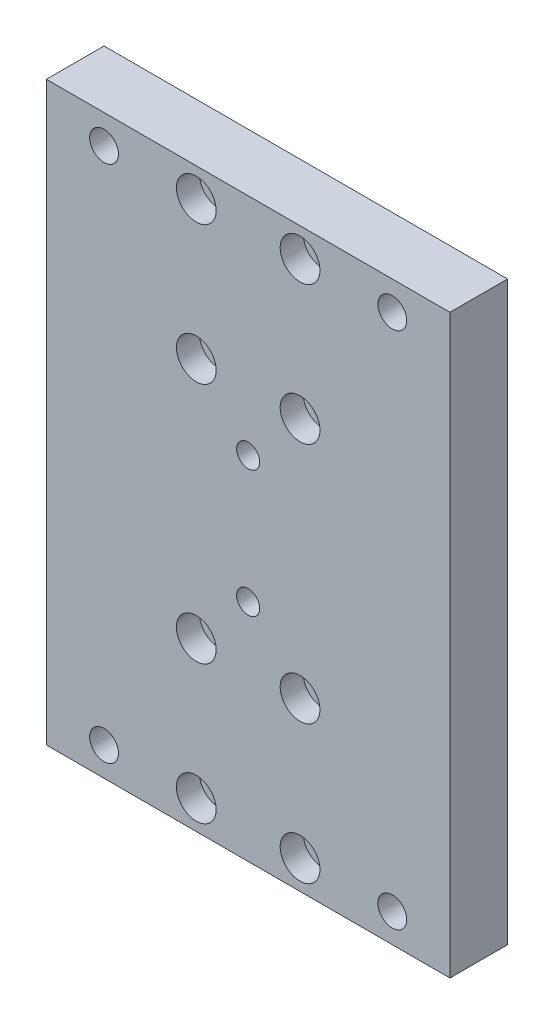
ISO-10303-21;
HEADER;
FILE_DESCRIPTION(('STEP AP214'),'2;1');
FILE_NAME('part.step','',(''),(''),'','','');
FILE_SCHEMA(('AUTOMOTIVE_DESIGN { 1 0 10303 214 1 1 1 1 }'));
ENDSEC;
DATA;
#1=APPLICATION_CONTEXT('core data for automotive mechanical design processes');
#2=APPLICATION_PROTOCOL_DEFINITION('international standard','automotive_design',2000,#1);
#3=PRODUCT_CONTEXT('',#1,'mechanical');
#4=PRODUCT('Part','Part','',(#3));
#5=PRODUCT_RELATED_PRODUCT_CATEGORY('part','',(#4));
#6=PRODUCT_DEFINITION_FORMATION('','',#4);
#7=PRODUCT_DEFINITION_CONTEXT('part definition',#1,'design');
#8=PRODUCT_DEFINITION('design','',#6,#7);
#9=PRODUCT_DEFINITION_SHAPE('','',#8);
#10=(LENGTH_UNIT() NAMED_UNIT(*) SI_UNIT(.MILLI.,.METRE.));
#11=(NAMED_UNIT(*) PLANE_ANGLE_UNIT() SI_UNIT($,.RADIAN.));
#12=(NAMED_UNIT(*) SI_UNIT($,.STERADIAN.) SOLID_ANGLE_UNIT());
#13=UNCERTAINTY_MEASURE_WITH_UNIT(LENGTH_MEASURE(1.E-05),#10,'distance_accuracy_value','');
#14=(GEOMETRIC_REPRESENTATION_CONTEXT(3) GLOBAL_UNCERTAINTY_ASSIGNED_CONTEXT((#13)) GLOBAL_UNIT_ASSIGNED_CONTEXT((#10,
#11,#12)) REPRESENTATION_CONTEXT('',''));
#15=CARTESIAN_POINT('',(0.,0.,0.));
#16=DIRECTION('',(0.,0.,1.));
#17=DIRECTION('',(1.,0.,0.));
#18=AXIS2_PLACEMENT_3D('',#15,#16,#17);
#19=CARTESIAN_POINT('',(-9.00000000000006,-20.9999999999998,10.));
#20=DIRECTION('',(0.,0.,-1.));
#21=DIRECTION('',(-1.,0.,0.));
#22=AXIS2_PLACEMENT_3D('',#19,#20,#21);
#23=CYLINDRICAL_SURFACE('',#22,1.5);
#24=CARTESIAN_POINT('',(-9.00000000000006,-20.9999999999998,0.));
#25=DIRECTION('',(0.,0.,-1.));
#26=DIRECTION('',(-1.,0.,0.));
#27=AXIS2_PLACEMENT_3D('',#24,#25,#26);
#28=CIRCLE('',#27,1.5);
#29=CARTESIAN_POINT('',(-10.5000000000001,-20.9999999999998,0.));
#30=VERTEX_POINT('',#29);
#31=EDGE_CURVE('E145',#30,#30,#28,.T.);
#32=ORIENTED_EDGE('',*,*,#31,.T.);
#33=EDGE_LOOP('',(#32));
#34=FACE_BOUND('',#33,.T.);
#35=CARTESIAN_POINT('',(-9.00000000000006,-20.9999999999998,6.));
#36=DIRECTION('',(0.,0.,1.));
#37=DIRECTION('',(1.,0.,0.));
#38=AXIS2_PLACEMENT_3D('',#35,#36,#37);
#39=CIRCLE('',#38,1.5);
#40=CARTESIAN_POINT('',(-7.50000000000006,-20.9999999999998,6.));
#41=VERTEX_POINT('',#40);
#42=EDGE_CURVE('E131',#41,#41,#39,.F.);
#43=ORIENTED_EDGE('',*,*,#42,.F.);
#44=EDGE_LOOP('',(#43));
#45=FACE_BOUND('',#44,.T.);
#46=ADVANCED_FACE('F37',(#34,#45),#23,.F.);
#47=CARTESIAN_POINT('',(8.99999999999985,-44.9999999999998,10.));
#48=DIRECTION('',(0.,0.,-1.));
#49=DIRECTION('',(-1.,0.,0.));
#50=AXIS2_PLACEMENT_3D('',#47,#48,#49);
#51=CYLINDRICAL_SURFACE('',#50,1.5);
#52=CARTESIAN_POINT('',(8.99999999999985,-44.9999999999998,0.));
#53=DIRECTION('',(0.,0.,-1.));
#54=DIRECTION('',(-1.,0.,0.));
#55=AXIS2_PLACEMENT_3D('',#52,#53,#54);
#56=CIRCLE('',#55,1.5);
#57=CARTESIAN_POINT('',(7.49999999999985,-44.9999999999998,0.));
#58=VERTEX_POINT('',#57);
#59=EDGE_CURVE('E140',#58,#58,#56,.T.);
#60=ORIENTED_EDGE('',*,*,#59,.T.);
#61=EDGE_LOOP('',(#60));
#62=FACE_BOUND('',#61,.T.);
#63=CARTESIAN_POINT('',(8.99999999999985,-44.9999999999998,6.));
#64=DIRECTION('',(0.,0.,1.));
#65=DIRECTION('',(1.,0.,0.));
#66=AXIS2_PLACEMENT_3D('',#63,#64,#65);
#67=CIRCLE('',#66,1.5);
#68=CARTESIAN_POINT('',(10.4999999999998,-44.9999999999998,6.));
#69=VERTEX_POINT('',#68);
#70=EDGE_CURVE('E129',#69,#69,#67,.F.);
#71=ORIENTED_EDGE('',*,*,#70,.F.);
#72=EDGE_LOOP('',(#71));
#73=FACE_BOUND('',#72,.T.);
#74=ADVANCED_FACE('F213',(#62,#73),#51,.F.);
#75=CARTESIAN_POINT('',(-8.99999999999984,45.0000000000002,10.));
#76=DIRECTION('',(0.,0.,-1.));
#77=DIRECTION('',(-1.,0.,0.));
#78=AXIS2_PLACEMENT_3D('',#75,#76,#77);
#79=CYLINDRICAL_SURFACE('',#78,1.5);
#80=CARTESIAN_POINT('',(-8.99999999999984,45.0000000000002,0.));
#81=DIRECTION('',(0.,0.,-1.));
#82=DIRECTION('',(-1.,0.,0.));
#83=AXIS2_PLACEMENT_3D('',#80,#81,#82);
#84=CIRCLE('',#83,1.5);
#85=CARTESIAN_POINT('',(-10.4999999999998,45.0000000000002,0.));
#86=VERTEX_POINT('',#85);
#87=EDGE_CURVE('E160',#86,#86,#84,.T.);
#88=ORIENTED_EDGE('',*,*,#87,.T.);
#89=EDGE_LOOP('',(#88));
#90=FACE_BOUND('',#89,.T.);
#91=CARTESIAN_POINT('',(-8.99999999999984,45.0000000000002,6.));
#92=DIRECTION('',(0.,0.,1.));
#93=DIRECTION('',(1.,0.,0.));
#94=AXIS2_PLACEMENT_3D('',#91,#92,#93);
#95=CIRCLE('',#94,1.5);
#96=CARTESIAN_POINT('',(-7.49999999999983,45.0000000000002,6.));
#97=VERTEX_POINT('',#96);
#98=EDGE_CURVE('E123',#97,#97,#95,.F.);
#99=ORIENTED_EDGE('',*,*,#98,.F.);
#100=EDGE_LOOP('',(#99));
#101=FACE_BOUND('',#100,.T.);
#102=ADVANCED_FACE('F220',(#90,#101),#79,.F.);
#103=CARTESIAN_POINT('',(9.00000000000008,21.0000000000002,10.));
#104=DIRECTION('',(0.,0.,-1.));
#105=DIRECTION('',(-1.,0.,0.));
#106=AXIS2_PLACEMENT_3D('',#103,#104,#105);
#107=CYLINDRICAL_SURFACE('',#106,1.5);
#108=CARTESIAN_POINT('',(9.00000000000008,21.0000000000002,0.));
#109=DIRECTION('',(0.,0.,-1.));
#110=DIRECTION('',(-1.,0.,0.));
#111=AXIS2_PLACEMENT_3D('',#108,#109,#110);
#112=CIRCLE('',#111,1.5);
#113=CARTESIAN_POINT('',(7.50000000000007,21.0000000000002,0.));
#114=VERTEX_POINT('',#113);
#115=EDGE_CURVE('E157',#114,#114,#112,.T.);
#116=ORIENTED_EDGE('',*,*,#115,.T.);
#117=EDGE_LOOP('',(#116));
#118=FACE_BOUND('',#117,.T.);
#119=CARTESIAN_POINT('',(9.00000000000008,21.0000000000002,6.));
#120=DIRECTION('',(0.,0.,1.));
#121=DIRECTION('',(1.,0.,0.));
#122=AXIS2_PLACEMENT_3D('',#119,#120,#121);
#123=CIRCLE('',#122,1.5);
#124=CARTESIAN_POINT('',(10.5000000000001,21.0000000000002,6.));
#125=VERTEX_POINT('',#124);
#126=EDGE_CURVE('E120',#125,#125,#123,.F.);
#127=ORIENTED_EDGE('',*,*,#126,.F.);
#128=EDGE_LOOP('',(#127));
#129=FACE_BOUND('',#128,.T.);
#130=ADVANCED_FACE('F239',(#118,#129),#107,.F.);
#131=CARTESIAN_POINT('',(-35.,-50.,10.));
#132=DIRECTION('',(1.,0.,0.));
#133=DIRECTION('',(0.,0.,-1.));
#134=AXIS2_PLACEMENT_3D('',#131,#132,#133);
#135=PLANE('',#134);
#136=DIRECTION('',(0.,-1.,0.));
#137=VECTOR('',#136,1.);
#138=CARTESIAN_POINT('',(-35.,-50.,0.));
#139=LINE('',#138,#137);
#140=CARTESIAN_POINT('',(-35.,50.,0.));
#141=VERTEX_POINT('',#140);
#142=CARTESIAN_POINT('',(-35.,-50.,0.));
#143=VERTEX_POINT('',#142);
#144=EDGE_CURVE('E104',#141,#143,#139,.T.);
#145=ORIENTED_EDGE('',*,*,#144,.T.);
#146=DIRECTION('',(0.,0.,-1.));
#147=VECTOR('',#146,1.);
#148=CARTESIAN_POINT('',(-35.,-50.,10.));
#149=LINE('',#148,#147);
#150=CARTESIAN_POINT('',(-35.,-50.,10.));
#151=VERTEX_POINT('',#150);
#152=EDGE_CURVE('E11',#151,#143,#149,.T.);
#153=ORIENTED_EDGE('',*,*,#152,.F.);
#154=DIRECTION('',(0.,-1.,0.));
#155=VECTOR('',#154,1.);
#156=CARTESIAN_POINT('',(-35.,-50.,10.));
#157=LINE('',#156,#155);
#158=CARTESIAN_POINT('',(-35.,50.,10.));
#159=VERTEX_POINT('',#158);
#160=EDGE_CURVE('E91',#159,#151,#157,.T.);
#161=ORIENTED_EDGE('',*,*,#160,.F.);
#162=DIRECTION('',(0.,0.,-1.));
#163=VECTOR('',#162,1.);
#164=CARTESIAN_POINT('',(-35.,50.,10.));
#165=LINE('',#164,#163);
#166=EDGE_CURVE('E100',#159,#141,#165,.T.);
#167=ORIENTED_EDGE('',*,*,#166,.T.);
#168=EDGE_LOOP('',(#145,#153,#161,#167));
#169=FACE_BOUND('',#168,.T.);
#170=ADVANCED_FACE('F39',(#169),#135,.F.);
#171=CARTESIAN_POINT('',(35.,-50.,10.));
#172=DIRECTION('',(0.,1.,0.));
#173=DIRECTION('',(-1.,0.,0.));
#174=AXIS2_PLACEMENT_3D('',#171,#172,#173);
#175=PLANE('',#174);
#176=DIRECTION('',(1.,0.,0.));
#177=VECTOR('',#176,1.);
#178=CARTESIAN_POINT('',(35.,-50.,0.));
#179=LINE('',#178,#177);
#180=CARTESIAN_POINT('',(35.,-50.,0.));
#181=VERTEX_POINT('',#180);
#182=EDGE_CURVE('E95',#143,#181,#179,.T.);
#183=ORIENTED_EDGE('',*,*,#182,.T.);
#184=DIRECTION('',(0.,0.,-1.));
#185=VECTOR('',#184,1.);
#186=CARTESIAN_POINT('',(35.,-50.,10.));
#187=LINE('',#186,#185);
#188=CARTESIAN_POINT('',(35.,-50.,10.));
#189=VERTEX_POINT('',#188);
#190=EDGE_CURVE('E47',#189,#181,#187,.T.);
#191=ORIENTED_EDGE('',*,*,#190,.F.);
#192=DIRECTION('',(1.,0.,0.));
#193=VECTOR('',#192,1.);
#194=CARTESIAN_POINT('',(35.,-50.,10.));
#195=LINE('',#194,#193);
#196=EDGE_CURVE('E86',#151,#189,#195,.T.);
#197=ORIENTED_EDGE('',*,*,#196,.F.);
#198=ORIENTED_EDGE('',*,*,#152,.T.);
#199=EDGE_LOOP('',(#183,#191,#197,#198));
#200=FACE_BOUND('',#199,.T.);
#201=ADVANCED_FACE('F94',(#200),#175,.F.);
#202=CARTESIAN_POINT('',(35.,-50.,10.));
#203=DIRECTION('',(-1.,0.,0.));
#204=DIRECTION('',(0.,0.,1.));
#205=AXIS2_PLACEMENT_3D('',#202,#203,#204);
#206=PLANE('',#205);
#207=DIRECTION('',(0.,1.,0.));
#208=VECTOR('',#207,1.);
#209=CARTESIAN_POINT('',(35.,-50.,0.));
#210=LINE('',#209,#208);
#211=CARTESIAN_POINT('',(35.,50.,0.));
#212=VERTEX_POINT('',#211);
#213=EDGE_CURVE('E73',#181,#212,#210,.T.);
#214=ORIENTED_EDGE('',*,*,#213,.T.);
#215=DIRECTION('',(0.,0.,-1.));
#216=VECTOR('',#215,1.);
#217=CARTESIAN_POINT('',(35.,50.,10.));
#218=LINE('',#217,#216);
#219=CARTESIAN_POINT('',(35.,50.,10.));
#220=VERTEX_POINT('',#219);
#221=EDGE_CURVE('E96',#220,#212,#218,.T.);
#222=ORIENTED_EDGE('',*,*,#221,.F.);
#223=DIRECTION('',(0.,1.,0.));
#224=VECTOR('',#223,1.);
#225=CARTESIAN_POINT('',(35.,-50.,10.));
#226=LINE('',#225,#224);
#227=EDGE_CURVE('E89',#189,#220,#226,.T.);
#228=ORIENTED_EDGE('',*,*,#227,.F.);
#229=ORIENTED_EDGE('',*,*,#190,.T.);
#230=EDGE_LOOP('',(#214,#222,#228,#229));
#231=FACE_BOUND('',#230,.T.);
#232=ADVANCED_FACE('F98',(#231),#206,.F.);
#233=CARTESIAN_POINT('',(35.,50.,10.));
#234=DIRECTION('',(0.,-1.,0.));
#235=DIRECTION('',(0.,0.,-1.));
#236=AXIS2_PLACEMENT_3D('',#233,#234,#235);
#237=PLANE('',#236);
#238=DIRECTION('',(-1.,0.,0.));
#239=VECTOR('',#238,1.);
#240=CARTESIAN_POINT('',(35.,50.,0.));
#241=LINE('',#240,#239);
#242=EDGE_CURVE('E79',#212,#141,#241,.T.);
#243=ORIENTED_EDGE('',*,*,#242,.T.);
#244=ORIENTED_EDGE('',*,*,#166,.F.);
#245=DIRECTION('',(-1.,0.,0.));
#246=VECTOR('',#245,1.);
#247=CARTESIAN_POINT('',(35.,50.,10.));
#248=LINE('',#247,#246);
#249=EDGE_CURVE('E56',#220,#159,#248,.T.);
#250=ORIENTED_EDGE('',*,*,#249,.F.);
#251=ORIENTED_EDGE('',*,*,#221,.T.);
#252=EDGE_LOOP('',(#243,#244,#250,#251));
#253=FACE_BOUND('',#252,.T.);
#254=ADVANCED_FACE('F201',(#253),#237,.F.);
#255=CARTESIAN_POINT('',(0.,0.,10.));
#256=DIRECTION('',(0.,0.,1.));
#257=DIRECTION('',(1.,0.,0.));
#258=AXIS2_PLACEMENT_3D('',#255,#256,#257);
#259=PLANE('',#258);
#260=CARTESIAN_POINT('',(0.,-11.,10.));
#261=DIRECTION('',(0.,0.,1.));
#262=DIRECTION('',(1.,0.,0.));
#263=AXIS2_PLACEMENT_3D('',#260,#261,#262);
#264=CIRCLE('',#263,2.);
#265=CARTESIAN_POINT('',(1.99999999999997,-11.,10.));
#266=VERTEX_POINT('',#265);
#267=EDGE_CURVE('E553',#266,#266,#264,.T.);
#268=ORIENTED_EDGE('',*,*,#267,.F.);
#269=EDGE_LOOP('',(#268));
#270=FACE_BOUND('',#269,.T.);
#271=CARTESIAN_POINT('',(0.,11.,10.));
#272=DIRECTION('',(0.,0.,1.));
#273=DIRECTION('',(1.,0.,0.));
#274=AXIS2_PLACEMENT_3D('',#271,#272,#273);
#275=CIRCLE('',#274,2.);
#276=CARTESIAN_POINT('',(2.00000000000004,11.,10.));
#277=VERTEX_POINT('',#276);
#278=EDGE_CURVE('E559',#277,#277,#275,.T.);
#279=ORIENTED_EDGE('',*,*,#278,.F.);
#280=EDGE_LOOP('',(#279));
#281=FACE_BOUND('',#280,.T.);
#282=CARTESIAN_POINT('',(8.99999999999983,-21.,10.));
#283=DIRECTION('',(0.,0.,1.));
#284=DIRECTION('',(-1.,0.,0.));
#285=AXIS2_PLACEMENT_3D('',#282,#283,#284);
#286=CIRCLE('',#285,3.45);
#287=CARTESIAN_POINT('',(5.54999999999983,-21.,10.));
#288=VERTEX_POINT('',#287);
#289=EDGE_CURVE('E567',#288,#288,#286,.T.);
#290=ORIENTED_EDGE('',*,*,#289,.F.);
#291=EDGE_LOOP('',(#290));
#292=FACE_BOUND('',#291,.T.);
#293=CARTESIAN_POINT('',(8.99999999999984,45.0000000000002,10.));
#294=DIRECTION('',(0.,0.,1.));
#295=DIRECTION('',(-1.,0.,0.));
#296=AXIS2_PLACEMENT_3D('',#293,#294,#295);
#297=CIRCLE('',#296,3.45);
#298=CARTESIAN_POINT('',(5.54999999999984,45.0000000000002,10.));
#299=VERTEX_POINT('',#298);
#300=EDGE_CURVE('E586',#299,#299,#297,.T.);
#301=ORIENTED_EDGE('',*,*,#300,.F.);
#302=EDGE_LOOP('',(#301));
#303=FACE_BOUND('',#302,.T.);
#304=CARTESIAN_POINT('',(8.99999999999984,21.,10.));
#305=DIRECTION('',(0.,0.,1.));
#306=DIRECTION('',(1.,0.,0.));
#307=AXIS2_PLACEMENT_3D('',#304,#305,#306);
#308=CIRCLE('',#307,3.45);
#309=CARTESIAN_POINT('',(12.4499999999998,21.,10.));
#310=VERTEX_POINT('',#309);
#311=EDGE_CURVE('E585',#310,#310,#308,.T.);
#312=ORIENTED_EDGE('',*,*,#311,.F.);
#313=EDGE_LOOP('',(#312));
#314=FACE_BOUND('',#313,.T.);
#315=CARTESIAN_POINT('',(-8.99999999999984,21.,10.));
#316=DIRECTION('',(0.,0.,1.));
#317=DIRECTION('',(-1.,0.,0.));
#318=AXIS2_PLACEMENT_3D('',#315,#316,#317);
#319=CIRCLE('',#318,3.45);
#320=CARTESIAN_POINT('',(-12.4499999999998,21.,10.));
#321=VERTEX_POINT('',#320);
#322=EDGE_CURVE('E597',#321,#321,#319,.T.);
#323=ORIENTED_EDGE('',*,*,#322,.F.);
#324=EDGE_LOOP('',(#323));
#325=FACE_BOUND('',#324,.T.);
#326=CARTESIAN_POINT('',(-8.99999999999984,-21.,10.));
#327=DIRECTION('',(0.,0.,1.));
#328=DIRECTION('',(1.,0.,0.));
#329=AXIS2_PLACEMENT_3D('',#326,#327,#328);
#330=CIRCLE('',#329,3.45);
#331=CARTESIAN_POINT('',(-5.54999999999984,-21.,10.));
#332=VERTEX_POINT('',#331);
#333=EDGE_CURVE('E568',#332,#332,#330,.T.);
#334=ORIENTED_EDGE('',*,*,#333,.F.);
#335=EDGE_LOOP('',(#334));
#336=FACE_BOUND('',#335,.T.);
#337=CARTESIAN_POINT('',(-8.99999999999985,-45.0000000000002,10.));
#338=DIRECTION('',(0.,0.,1.));
#339=DIRECTION('',(-1.,0.,0.));
#340=AXIS2_PLACEMENT_3D('',#337,#338,#339);
#341=CIRCLE('',#340,3.45);
#342=CARTESIAN_POINT('',(-12.4499999999999,-45.0000000000002,10.));
#343=VERTEX_POINT('',#342);
#344=EDGE_CURVE('E574',#343,#343,#341,.T.);
#345=ORIENTED_EDGE('',*,*,#344,.F.);
#346=EDGE_LOOP('',(#345));
#347=FACE_BOUND('',#346,.T.);
#348=CARTESIAN_POINT('',(8.99999999999982,-45.0000000000002,10.));
#349=DIRECTION('',(0.,0.,1.));
#350=DIRECTION('',(1.,0.,0.));
#351=AXIS2_PLACEMENT_3D('',#348,#349,#350);
#352=CIRCLE('',#351,3.45);
#353=CARTESIAN_POINT('',(12.4499999999998,-45.0000000000002,10.));
#354=VERTEX_POINT('',#353);
#355=EDGE_CURVE('E556',#354,#354,#352,.T.);
#356=ORIENTED_EDGE('',*,*,#355,.F.);
#357=EDGE_LOOP('',(#356));
#358=FACE_BOUND('',#357,.T.);
#359=CARTESIAN_POINT('',(-8.99999999999984,45.0000000000002,10.));
#360=DIRECTION('',(0.,0.,1.));
#361=DIRECTION('',(1.,0.,0.));
#362=AXIS2_PLACEMENT_3D('',#359,#360,#361);
#363=CIRCLE('',#362,3.45);
#364=CARTESIAN_POINT('',(-5.54999999999984,45.0000000000002,10.));
#365=VERTEX_POINT('',#364);
#366=EDGE_CURVE('E149',#365,#365,#363,.T.);
#367=ORIENTED_EDGE('',*,*,#366,.F.);
#368=EDGE_LOOP('',(#367));
#369=FACE_BOUND('',#368,.T.);
#370=CARTESIAN_POINT('',(-25.,45.,10.));
#371=DIRECTION('',(0.,0.,-1.));
#372=DIRECTION('',(1.,0.,0.));
#373=AXIS2_PLACEMENT_3D('',#370,#371,#372);
#374=CIRCLE('',#373,2.5);
#375=CARTESIAN_POINT('',(-22.5,45.,10.));
#376=VERTEX_POINT('',#375);
#377=EDGE_CURVE('E175',#376,#376,#374,.T.);
#378=ORIENTED_EDGE('',*,*,#377,.T.);
#379=EDGE_LOOP('',(#378));
#380=FACE_BOUND('',#379,.T.);
#381=CARTESIAN_POINT('',(25.,-45.,10.));
#382=DIRECTION('',(0.,0.,-1.));
#383=DIRECTION('',(1.,0.,0.));
#384=AXIS2_PLACEMENT_3D('',#381,#382,#383);
#385=CIRCLE('',#384,2.5);
#386=CARTESIAN_POINT('',(27.5,-45.,10.));
#387=VERTEX_POINT('',#386);
#388=EDGE_CURVE('E182',#387,#387,#385,.T.);
#389=ORIENTED_EDGE('',*,*,#388,.T.);
#390=EDGE_LOOP('',(#389));
#391=FACE_BOUND('',#390,.T.);
#392=CARTESIAN_POINT('',(-25.,-45.,10.));
#393=DIRECTION('',(0.,0.,-1.));
#394=DIRECTION('',(-1.,0.,0.));
#395=AXIS2_PLACEMENT_3D('',#392,#393,#394);
#396=CIRCLE('',#395,2.5);
#397=CARTESIAN_POINT('',(-27.5,-45.,10.));
#398=VERTEX_POINT('',#397);
#399=EDGE_CURVE('E169',#398,#398,#396,.T.);
#400=ORIENTED_EDGE('',*,*,#399,.T.);
#401=EDGE_LOOP('',(#400));
#402=FACE_BOUND('',#401,.T.);
#403=CARTESIAN_POINT('',(25.,45.,10.));
#404=DIRECTION('',(0.,0.,-1.));
#405=DIRECTION('',(-1.,0.,0.));
#406=AXIS2_PLACEMENT_3D('',#403,#404,#405);
#407=CIRCLE('',#406,2.5);
#408=CARTESIAN_POINT('',(22.5,45.,10.));
#409=VERTEX_POINT('',#408);
#410=EDGE_CURVE('E107',#409,#409,#407,.T.);
#411=ORIENTED_EDGE('',*,*,#410,.T.);
#412=EDGE_LOOP('',(#411));
#413=FACE_BOUND('',#412,.T.);
#414=ORIENTED_EDGE('',*,*,#160,.T.);
#415=ORIENTED_EDGE('',*,*,#196,.T.);
#416=ORIENTED_EDGE('',*,*,#227,.T.);
#417=ORIENTED_EDGE('',*,*,#249,.T.);
#418=EDGE_LOOP('',(#414,#415,#416,#417));
#419=FACE_BOUND('',#418,.T.);
#420=ADVANCED_FACE('F87',(#270,#281,#292,#303,#314,#325,#336,#347,#358,#369,#380,#391,#402,#413,
#419),#259,.T.);
#421=CARTESIAN_POINT('',(0.,0.,0.));
#422=DIRECTION('',(0.,0.,1.));
#423=DIRECTION('',(1.,0.,0.));
#424=AXIS2_PLACEMENT_3D('',#421,#422,#423);
#425=PLANE('',#424);
#426=CARTESIAN_POINT('',(0.,-11.,0.));
#427=DIRECTION('',(0.,0.,1.));
#428=DIRECTION('',(1.,0.,0.));
#429=AXIS2_PLACEMENT_3D('',#426,#427,#428);
#430=CIRCLE('',#429,2.);
#431=CARTESIAN_POINT('',(1.99999999999997,-11.,0.));
#432=VERTEX_POINT('',#431);
#433=EDGE_CURVE('E550',#432,#432,#430,.T.);
#434=ORIENTED_EDGE('',*,*,#433,.T.);
#435=EDGE_LOOP('',(#434));
#436=FACE_BOUND('',#435,.T.);
#437=CARTESIAN_POINT('',(0.,11.,0.));
#438=DIRECTION('',(0.,0.,1.));
#439=DIRECTION('',(1.,0.,0.));
#440=AXIS2_PLACEMENT_3D('',#437,#438,#439);
#441=CIRCLE('',#440,2.);
#442=CARTESIAN_POINT('',(2.00000000000004,11.,0.));
#443=VERTEX_POINT('',#442);
#444=EDGE_CURVE('E554',#443,#443,#441,.T.);
#445=ORIENTED_EDGE('',*,*,#444,.T.);
#446=EDGE_LOOP('',(#445));
#447=FACE_BOUND('',#446,.T.);
#448=CARTESIAN_POINT('',(-9.00000000000015,-44.9999999999998,0.));
#449=DIRECTION('',(0.,0.,-1.));
#450=DIRECTION('',(-1.,0.,0.));
#451=AXIS2_PLACEMENT_3D('',#448,#449,#450);
#452=CIRCLE('',#451,1.5);
#453=CARTESIAN_POINT('',(-10.5000000000002,-44.9999999999998,0.));
#454=VERTEX_POINT('',#453);
#455=EDGE_CURVE('E152',#454,#454,#452,.T.);
#456=ORIENTED_EDGE('',*,*,#455,.F.);
#457=EDGE_LOOP('',(#456));
#458=FACE_BOUND('',#457,.T.);
#459=CARTESIAN_POINT('',(9.00000000000016,45.0000000000002,0.));
#460=DIRECTION('',(0.,0.,-1.));
#461=DIRECTION('',(-1.,0.,0.));
#462=AXIS2_PLACEMENT_3D('',#459,#460,#461);
#463=CIRCLE('',#462,1.5);
#464=CARTESIAN_POINT('',(7.50000000000016,45.0000000000002,0.));
#465=VERTEX_POINT('',#464);
#466=EDGE_CURVE('E154',#465,#465,#463,.T.);
#467=ORIENTED_EDGE('',*,*,#466,.F.);
#468=EDGE_LOOP('',(#467));
#469=FACE_BOUND('',#468,.T.);
#470=ORIENTED_EDGE('',*,*,#115,.F.);
#471=EDGE_LOOP('',(#470));
#472=FACE_BOUND('',#471,.T.);
#473=ORIENTED_EDGE('',*,*,#87,.F.);
#474=EDGE_LOOP('',(#473));
#475=FACE_BOUND('',#474,.T.);
#476=CARTESIAN_POINT('',(8.99999999999993,-20.9999999999998,0.));
#477=DIRECTION('',(0.,0.,-1.));
#478=DIRECTION('',(-1.,0.,0.));
#479=AXIS2_PLACEMENT_3D('',#476,#477,#478);
#480=CIRCLE('',#479,1.5);
#481=CARTESIAN_POINT('',(7.49999999999993,-20.9999999999998,0.));
#482=VERTEX_POINT('',#481);
#483=EDGE_CURVE('E136',#482,#482,#480,.T.);
#484=ORIENTED_EDGE('',*,*,#483,.F.);
#485=EDGE_LOOP('',(#484));
#486=FACE_BOUND('',#485,.T.);
#487=ORIENTED_EDGE('',*,*,#59,.F.);
#488=EDGE_LOOP('',(#487));
#489=FACE_BOUND('',#488,.T.);
#490=ORIENTED_EDGE('',*,*,#31,.F.);
#491=EDGE_LOOP('',(#490));
#492=FACE_BOUND('',#491,.T.);
#493=CARTESIAN_POINT('',(-8.99999999999992,21.0000000000002,0.));
#494=DIRECTION('',(0.,0.,-1.));
#495=DIRECTION('',(-1.,0.,0.));
#496=AXIS2_PLACEMENT_3D('',#493,#494,#495);
#497=CIRCLE('',#496,1.5);
#498=CARTESIAN_POINT('',(-10.4999999999999,21.0000000000002,0.));
#499=VERTEX_POINT('',#498);
#500=EDGE_CURVE('E163',#499,#499,#497,.T.);
#501=ORIENTED_EDGE('',*,*,#500,.F.);
#502=EDGE_LOOP('',(#501));
#503=FACE_BOUND('',#502,.T.);
#504=CARTESIAN_POINT('',(-25.,45.,0.));
#505=DIRECTION('',(0.,0.,-1.));
#506=DIRECTION('',(1.,0.,0.));
#507=AXIS2_PLACEMENT_3D('',#504,#505,#506);
#508=CIRCLE('',#507,2.5);
#509=CARTESIAN_POINT('',(-22.5,45.,0.));
#510=VERTEX_POINT('',#509);
#511=EDGE_CURVE('E179',#510,#510,#508,.T.);
#512=ORIENTED_EDGE('',*,*,#511,.F.);
#513=EDGE_LOOP('',(#512));
#514=FACE_BOUND('',#513,.T.);
#515=CARTESIAN_POINT('',(25.,-45.,0.));
#516=DIRECTION('',(0.,0.,-1.));
#517=DIRECTION('',(1.,0.,0.));
#518=AXIS2_PLACEMENT_3D('',#515,#516,#517);
#519=CIRCLE('',#518,2.5);
#520=CARTESIAN_POINT('',(27.5,-45.,0.));
#521=VERTEX_POINT('',#520);
#522=EDGE_CURVE('E172',#521,#521,#519,.T.);
#523=ORIENTED_EDGE('',*,*,#522,.F.);
#524=EDGE_LOOP('',(#523));
#525=FACE_BOUND('',#524,.T.);
#526=CARTESIAN_POINT('',(-25.,-45.,0.));
#527=DIRECTION('',(0.,0.,-1.));
#528=DIRECTION('',(-1.,0.,0.));
#529=AXIS2_PLACEMENT_3D('',#526,#527,#528);
#530=CIRCLE('',#529,2.5);
#531=CARTESIAN_POINT('',(-27.5,-45.,0.));
#532=VERTEX_POINT('',#531);
#533=EDGE_CURVE('E168',#532,#532,#530,.T.);
#534=ORIENTED_EDGE('',*,*,#533,.F.);
#535=EDGE_LOOP('',(#534));
#536=FACE_BOUND('',#535,.T.);
#537=CARTESIAN_POINT('',(25.,45.,0.));
#538=DIRECTION('',(0.,0.,-1.));
#539=DIRECTION('',(-1.,0.,0.));
#540=AXIS2_PLACEMENT_3D('',#537,#538,#539);
#541=CIRCLE('',#540,2.5);
#542=CARTESIAN_POINT('',(22.5,45.,0.));
#543=VERTEX_POINT('',#542);
#544=EDGE_CURVE('E178',#543,#543,#541,.T.);
#545=ORIENTED_EDGE('',*,*,#544,.F.);
#546=EDGE_LOOP('',(#545));
#547=FACE_BOUND('',#546,.T.);
#548=ORIENTED_EDGE('',*,*,#144,.F.);
#549=ORIENTED_EDGE('',*,*,#242,.F.);
#550=ORIENTED_EDGE('',*,*,#213,.F.);
#551=ORIENTED_EDGE('',*,*,#182,.F.);
#552=EDGE_LOOP('',(#548,#549,#550,#551));
#553=FACE_BOUND('',#552,.T.);
#554=ADVANCED_FACE('F194',(#436,#447,#458,#469,#472,#475,#486,#489,#492,#503,#514,#525,#536,
#547,#553),#425,.F.);
#555=CARTESIAN_POINT('',(25.,45.,10.));
#556=DIRECTION('',(0.,0.,-1.));
#557=DIRECTION('',(-1.,0.,0.));
#558=AXIS2_PLACEMENT_3D('',#555,#556,#557);
#559=CYLINDRICAL_SURFACE('',#558,2.5);
#560=ORIENTED_EDGE('',*,*,#410,.F.);
#561=EDGE_LOOP('',(#560));
#562=FACE_BOUND('',#561,.T.);
#563=ORIENTED_EDGE('',*,*,#544,.T.);
#564=EDGE_LOOP('',(#563));
#565=FACE_BOUND('',#564,.T.);
#566=ADVANCED_FACE('F192',(#562,#565),#559,.F.);
#567=CARTESIAN_POINT('',(-25.,-45.,10.));
#568=DIRECTION('',(0.,0.,-1.));
#569=DIRECTION('',(-1.,0.,0.));
#570=AXIS2_PLACEMENT_3D('',#567,#568,#569);
#571=CYLINDRICAL_SURFACE('',#570,2.5);
#572=ORIENTED_EDGE('',*,*,#399,.F.);
#573=EDGE_LOOP('',(#572));
#574=FACE_BOUND('',#573,.T.);
#575=ORIENTED_EDGE('',*,*,#533,.T.);
#576=EDGE_LOOP('',(#575));
#577=FACE_BOUND('',#576,.T.);
#578=ADVANCED_FACE('F248',(#574,#577),#571,.F.);
#579=CARTESIAN_POINT('',(25.,-45.,10.));
#580=DIRECTION('',(0.,0.,-1.));
#581=DIRECTION('',(-1.,0.,0.));
#582=AXIS2_PLACEMENT_3D('',#579,#580,#581);
#583=CYLINDRICAL_SURFACE('',#582,2.5);
#584=ORIENTED_EDGE('',*,*,#388,.F.);
#585=EDGE_LOOP('',(#584));
#586=FACE_BOUND('',#585,.T.);
#587=ORIENTED_EDGE('',*,*,#522,.T.);
#588=EDGE_LOOP('',(#587));
#589=FACE_BOUND('',#588,.T.);
#590=ADVANCED_FACE('F251',(#586,#589),#583,.F.);
#591=CARTESIAN_POINT('',(-25.,45.,10.));
#592=DIRECTION('',(0.,0.,-1.));
#593=DIRECTION('',(-1.,0.,0.));
#594=AXIS2_PLACEMENT_3D('',#591,#592,#593);
#595=CYLINDRICAL_SURFACE('',#594,2.5);
#596=ORIENTED_EDGE('',*,*,#377,.F.);
#597=EDGE_LOOP('',(#596));
#598=FACE_BOUND('',#597,.T.);
#599=ORIENTED_EDGE('',*,*,#511,.T.);
#600=EDGE_LOOP('',(#599));
#601=FACE_BOUND('',#600,.T.);
#602=ADVANCED_FACE('F247',(#598,#601),#595,.F.);
#603=CARTESIAN_POINT('',(-8.99999999999992,21.0000000000002,10.));
#604=DIRECTION('',(0.,0.,-1.));
#605=DIRECTION('',(-1.,0.,0.));
#606=AXIS2_PLACEMENT_3D('',#603,#604,#605);
#607=CYLINDRICAL_SURFACE('',#606,1.5);
#608=CARTESIAN_POINT('',(-8.99999999999992,21.0000000000002,6.));
#609=DIRECTION('',(0.,0.,-1.));
#610=DIRECTION('',(-1.,0.,0.));
#611=AXIS2_PLACEMENT_3D('',#608,#609,#610);
#612=CIRCLE('',#611,1.5);
#613=CARTESIAN_POINT('',(-10.4999999999999,21.0000000000002,6.));
#614=VERTEX_POINT('',#613);
#615=EDGE_CURVE('E41',#614,#614,#612,.F.);
#616=ORIENTED_EDGE('',*,*,#615,.T.);
#617=EDGE_LOOP('',(#616));
#618=FACE_BOUND('',#617,.T.);
#619=ORIENTED_EDGE('',*,*,#500,.T.);
#620=EDGE_LOOP('',(#619));
#621=FACE_BOUND('',#620,.T.);
#622=ADVANCED_FACE('F244',(#618,#621),#607,.F.);
#623=CARTESIAN_POINT('',(8.99999999999993,-20.9999999999998,10.));
#624=DIRECTION('',(0.,0.,-1.));
#625=DIRECTION('',(-1.,0.,0.));
#626=AXIS2_PLACEMENT_3D('',#623,#624,#625);
#627=CYLINDRICAL_SURFACE('',#626,1.5);
#628=CARTESIAN_POINT('',(8.99999999999993,-20.9999999999998,6.));
#629=DIRECTION('',(0.,0.,-1.));
#630=DIRECTION('',(-1.,0.,0.));
#631=AXIS2_PLACEMENT_3D('',#628,#629,#630);
#632=CIRCLE('',#631,1.5);
#633=CARTESIAN_POINT('',(7.49999999999993,-20.9999999999998,6.));
#634=VERTEX_POINT('',#633);
#635=EDGE_CURVE('E126',#634,#634,#632,.F.);
#636=ORIENTED_EDGE('',*,*,#635,.T.);
#637=EDGE_LOOP('',(#636));
#638=FACE_BOUND('',#637,.T.);
#639=ORIENTED_EDGE('',*,*,#483,.T.);
#640=EDGE_LOOP('',(#639));
#641=FACE_BOUND('',#640,.T.);
#642=ADVANCED_FACE('F225',(#638,#641),#627,.F.);
#643=CARTESIAN_POINT('',(9.00000000000016,45.0000000000002,10.));
#644=DIRECTION('',(0.,0.,-1.));
#645=DIRECTION('',(-1.,0.,0.));
#646=AXIS2_PLACEMENT_3D('',#643,#644,#645);
#647=CYLINDRICAL_SURFACE('',#646,1.5);
#648=CARTESIAN_POINT('',(9.00000000000016,45.0000000000002,6.));
#649=DIRECTION('',(0.,0.,-1.));
#650=DIRECTION('',(-1.,0.,0.));
#651=AXIS2_PLACEMENT_3D('',#648,#649,#650);
#652=CIRCLE('',#651,1.5);
#653=CARTESIAN_POINT('',(7.50000000000016,45.0000000000002,6.));
#654=VERTEX_POINT('',#653);
#655=EDGE_CURVE('E116',#654,#654,#652,.F.);
#656=ORIENTED_EDGE('',*,*,#655,.T.);
#657=EDGE_LOOP('',(#656));
#658=FACE_BOUND('',#657,.T.);
#659=ORIENTED_EDGE('',*,*,#466,.T.);
#660=EDGE_LOOP('',(#659));
#661=FACE_BOUND('',#660,.T.);
#662=ADVANCED_FACE('F228',(#658,#661),#647,.F.);
#663=CARTESIAN_POINT('',(-9.00000000000015,-44.9999999999998,10.));
#664=DIRECTION('',(0.,0.,-1.));
#665=DIRECTION('',(-1.,0.,0.));
#666=AXIS2_PLACEMENT_3D('',#663,#664,#665);
#667=CYLINDRICAL_SURFACE('',#666,1.5);
#668=CARTESIAN_POINT('',(-9.00000000000015,-44.9999999999998,6.));
#669=DIRECTION('',(0.,0.,-1.));
#670=DIRECTION('',(-1.,0.,0.));
#671=AXIS2_PLACEMENT_3D('',#668,#669,#670);
#672=CIRCLE('',#671,1.5);
#673=CARTESIAN_POINT('',(-10.5000000000002,-44.9999999999998,6.));
#674=VERTEX_POINT('',#673);
#675=EDGE_CURVE('E113',#674,#674,#672,.F.);
#676=ORIENTED_EDGE('',*,*,#675,.T.);
#677=EDGE_LOOP('',(#676));
#678=FACE_BOUND('',#677,.T.);
#679=ORIENTED_EDGE('',*,*,#455,.T.);
#680=EDGE_LOOP('',(#679));
#681=FACE_BOUND('',#680,.T.);
#682=ADVANCED_FACE('F231',(#678,#681),#667,.F.);
#683=CARTESIAN_POINT('',(-8.99999999999985,-45.0000000000002,6.));
#684=DIRECTION('',(0.,0.,-1.));
#685=DIRECTION('',(-1.,0.,0.));
#686=AXIS2_PLACEMENT_3D('',#683,#684,#685);
#687=PLANE('',#686);
#688=CARTESIAN_POINT('',(-8.99999999999985,-45.0000000000002,6.));
#689=DIRECTION('',(0.,0.,1.));
#690=DIRECTION('',(-1.,0.,0.));
#691=AXIS2_PLACEMENT_3D('',#688,#689,#690);
#692=CIRCLE('',#691,3.45);
#693=CARTESIAN_POINT('',(-12.4499999999999,-45.0000000000002,6.));
#694=VERTEX_POINT('',#693);
#695=EDGE_CURVE('E571',#694,#694,#692,.T.);
#696=ORIENTED_EDGE('',*,*,#695,.T.);
#697=EDGE_LOOP('',(#696));
#698=FACE_BOUND('',#697,.T.);
#699=ORIENTED_EDGE('',*,*,#675,.F.);
#700=EDGE_LOOP('',(#699));
#701=FACE_BOUND('',#700,.T.);
#702=ADVANCED_FACE('F235',(#698,#701),#687,.F.);
#703=CARTESIAN_POINT('',(-8.99999999999985,-45.0000000000002,6.));
#704=DIRECTION('',(0.,0.,1.));
#705=DIRECTION('',(1.,0.,0.));
#706=AXIS2_PLACEMENT_3D('',#703,#704,#705);
#707=CYLINDRICAL_SURFACE('',#706,3.45);
#708=ORIENTED_EDGE('',*,*,#695,.F.);
#709=EDGE_LOOP('',(#708));
#710=FACE_BOUND('',#709,.T.);
#711=ORIENTED_EDGE('',*,*,#344,.T.);
#712=EDGE_LOOP('',(#711));
#713=FACE_BOUND('',#712,.T.);
#714=ADVANCED_FACE('F303',(#710,#713),#707,.F.);
#715=CARTESIAN_POINT('',(8.99999999999984,45.0000000000002,6.));
#716=DIRECTION('',(0.,0.,-1.));
#717=DIRECTION('',(-1.,0.,0.));
#718=AXIS2_PLACEMENT_3D('',#715,#716,#717);
#719=PLANE('',#718);
#720=CARTESIAN_POINT('',(8.99999999999984,45.0000000000002,6.));
#721=DIRECTION('',(0.,0.,1.));
#722=DIRECTION('',(-1.,0.,0.));
#723=AXIS2_PLACEMENT_3D('',#720,#721,#722);
#724=CIRCLE('',#723,3.45);
#725=CARTESIAN_POINT('',(5.54999999999984,45.0000000000002,6.));
#726=VERTEX_POINT('',#725);
#727=EDGE_CURVE('E582',#726,#726,#724,.T.);
#728=ORIENTED_EDGE('',*,*,#727,.T.);
#729=EDGE_LOOP('',(#728));
#730=FACE_BOUND('',#729,.T.);
#731=ORIENTED_EDGE('',*,*,#655,.F.);
#732=EDGE_LOOP('',(#731));
#733=FACE_BOUND('',#732,.T.);
#734=ADVANCED_FACE('F311',(#730,#733),#719,.F.);
#735=CARTESIAN_POINT('',(8.99999999999984,45.0000000000002,6.));
#736=DIRECTION('',(0.,0.,1.));
#737=DIRECTION('',(1.,0.,0.));
#738=AXIS2_PLACEMENT_3D('',#735,#736,#737);
#739=CYLINDRICAL_SURFACE('',#738,3.45);
#740=ORIENTED_EDGE('',*,*,#727,.F.);
#741=EDGE_LOOP('',(#740));
#742=FACE_BOUND('',#741,.T.);
#743=ORIENTED_EDGE('',*,*,#300,.T.);
#744=EDGE_LOOP('',(#743));
#745=FACE_BOUND('',#744,.T.);
#746=ADVANCED_FACE('F319',(#742,#745),#739,.F.);
#747=CARTESIAN_POINT('',(8.99999999999984,21.,6.));
#748=DIRECTION('',(0.,0.,1.));
#749=DIRECTION('',(1.,0.,0.));
#750=AXIS2_PLACEMENT_3D('',#747,#748,#749);
#751=PLANE('',#750);
#752=CARTESIAN_POINT('',(8.99999999999984,21.,6.));
#753=DIRECTION('',(0.,0.,1.));
#754=DIRECTION('',(1.,0.,0.));
#755=AXIS2_PLACEMENT_3D('',#752,#753,#754);
#756=CIRCLE('',#755,3.45);
#757=CARTESIAN_POINT('',(12.4499999999998,21.,6.));
#758=VERTEX_POINT('',#757);
#759=EDGE_CURVE('E600',#758,#758,#756,.T.);
#760=ORIENTED_EDGE('',*,*,#759,.T.);
#761=EDGE_LOOP('',(#760));
#762=FACE_BOUND('',#761,.T.);
#763=ORIENTED_EDGE('',*,*,#126,.T.);
#764=EDGE_LOOP('',(#763));
#765=FACE_BOUND('',#764,.T.);
#766=ADVANCED_FACE('F327',(#762,#765),#751,.T.);
#767=CARTESIAN_POINT('',(8.99999999999984,21.,6.));
#768=DIRECTION('',(0.,0.,1.));
#769=DIRECTION('',(1.,0.,0.));
#770=AXIS2_PLACEMENT_3D('',#767,#768,#769);
#771=CYLINDRICAL_SURFACE('',#770,3.45);
#772=ORIENTED_EDGE('',*,*,#759,.F.);
#773=EDGE_LOOP('',(#772));
#774=FACE_BOUND('',#773,.T.);
#775=ORIENTED_EDGE('',*,*,#311,.T.);
#776=EDGE_LOOP('',(#775));
#777=FACE_BOUND('',#776,.T.);
#778=ADVANCED_FACE('F335',(#774,#777),#771,.F.);
#779=CARTESIAN_POINT('',(-8.99999999999984,45.0000000000002,6.));
#780=DIRECTION('',(0.,0.,1.));
#781=DIRECTION('',(1.,0.,0.));
#782=AXIS2_PLACEMENT_3D('',#779,#780,#781);
#783=PLANE('',#782);
#784=CARTESIAN_POINT('',(-8.99999999999984,45.0000000000002,6.));
#785=DIRECTION('',(0.,0.,1.));
#786=DIRECTION('',(1.,0.,0.));
#787=AXIS2_PLACEMENT_3D('',#784,#785,#786);
#788=CIRCLE('',#787,3.45);
#789=CARTESIAN_POINT('',(-5.54999999999984,45.0000000000002,6.));
#790=VERTEX_POINT('',#789);
#791=EDGE_CURVE('E117',#790,#790,#788,.T.);
#792=ORIENTED_EDGE('',*,*,#791,.T.);
#793=EDGE_LOOP('',(#792));
#794=FACE_BOUND('',#793,.T.);
#795=ORIENTED_EDGE('',*,*,#98,.T.);
#796=EDGE_LOOP('',(#795));
#797=FACE_BOUND('',#796,.T.);
#798=ADVANCED_FACE('F343',(#794,#797),#783,.T.);
#799=CARTESIAN_POINT('',(-8.99999999999984,45.0000000000002,6.));
#800=DIRECTION('',(0.,0.,1.));
#801=DIRECTION('',(1.,0.,0.));
#802=AXIS2_PLACEMENT_3D('',#799,#800,#801);
#803=CYLINDRICAL_SURFACE('',#802,3.45);
#804=ORIENTED_EDGE('',*,*,#791,.F.);
#805=EDGE_LOOP('',(#804));
#806=FACE_BOUND('',#805,.T.);
#807=ORIENTED_EDGE('',*,*,#366,.T.);
#808=EDGE_LOOP('',(#807));
#809=FACE_BOUND('',#808,.T.);
#810=ADVANCED_FACE('F351',(#806,#809),#803,.F.);
#811=CARTESIAN_POINT('',(8.99999999999983,-21.,6.));
#812=DIRECTION('',(0.,0.,-1.));
#813=DIRECTION('',(-1.,0.,0.));
#814=AXIS2_PLACEMENT_3D('',#811,#812,#813);
#815=PLANE('',#814);
#816=CARTESIAN_POINT('',(8.99999999999983,-21.,6.));
#817=DIRECTION('',(0.,0.,1.));
#818=DIRECTION('',(-1.,0.,0.));
#819=AXIS2_PLACEMENT_3D('',#816,#817,#818);
#820=CIRCLE('',#819,3.45);
#821=CARTESIAN_POINT('',(5.54999999999983,-21.,6.));
#822=VERTEX_POINT('',#821);
#823=EDGE_CURVE('E589',#822,#822,#820,.T.);
#824=ORIENTED_EDGE('',*,*,#823,.T.);
#825=EDGE_LOOP('',(#824));
#826=FACE_BOUND('',#825,.T.);
#827=ORIENTED_EDGE('',*,*,#635,.F.);
#828=EDGE_LOOP('',(#827));
#829=FACE_BOUND('',#828,.T.);
#830=ADVANCED_FACE('F359',(#826,#829),#815,.F.);
#831=CARTESIAN_POINT('',(8.99999999999983,-21.,6.));
#832=DIRECTION('',(0.,0.,1.));
#833=DIRECTION('',(1.,0.,0.));
#834=AXIS2_PLACEMENT_3D('',#831,#832,#833);
#835=CYLINDRICAL_SURFACE('',#834,3.45);
#836=ORIENTED_EDGE('',*,*,#823,.F.);
#837=EDGE_LOOP('',(#836));
#838=FACE_BOUND('',#837,.T.);
#839=ORIENTED_EDGE('',*,*,#289,.T.);
#840=EDGE_LOOP('',(#839));
#841=FACE_BOUND('',#840,.T.);
#842=ADVANCED_FACE('F366',(#838,#841),#835,.F.);
#843=CARTESIAN_POINT('',(8.99999999999982,-45.0000000000002,6.));
#844=DIRECTION('',(0.,0.,1.));
#845=DIRECTION('',(1.,0.,0.));
#846=AXIS2_PLACEMENT_3D('',#843,#844,#845);
#847=PLANE('',#846);
#848=CARTESIAN_POINT('',(8.99999999999982,-45.0000000000002,6.));
#849=DIRECTION('',(0.,0.,1.));
#850=DIRECTION('',(1.,0.,0.));
#851=AXIS2_PLACEMENT_3D('',#848,#849,#850);
#852=CIRCLE('',#851,3.45);
#853=CARTESIAN_POINT('',(12.4499999999998,-45.0000000000002,6.));
#854=VERTEX_POINT('',#853);
#855=EDGE_CURVE('E577',#854,#854,#852,.T.);
#856=ORIENTED_EDGE('',*,*,#855,.T.);
#857=EDGE_LOOP('',(#856));
#858=FACE_BOUND('',#857,.T.);
#859=ORIENTED_EDGE('',*,*,#70,.T.);
#860=EDGE_LOOP('',(#859));
#861=FACE_BOUND('',#860,.T.);
#862=ADVANCED_FACE('F374',(#858,#861),#847,.T.);
#863=CARTESIAN_POINT('',(8.99999999999982,-45.0000000000002,6.));
#864=DIRECTION('',(0.,0.,1.));
#865=DIRECTION('',(1.,0.,0.));
#866=AXIS2_PLACEMENT_3D('',#863,#864,#865);
#867=CYLINDRICAL_SURFACE('',#866,3.45);
#868=ORIENTED_EDGE('',*,*,#855,.F.);
#869=EDGE_LOOP('',(#868));
#870=FACE_BOUND('',#869,.T.);
#871=ORIENTED_EDGE('',*,*,#355,.T.);
#872=EDGE_LOOP('',(#871));
#873=FACE_BOUND('',#872,.T.);
#874=ADVANCED_FACE('F382',(#870,#873),#867,.F.);
#875=CARTESIAN_POINT('',(-8.99999999999984,-21.,6.));
#876=DIRECTION('',(0.,0.,1.));
#877=DIRECTION('',(1.,0.,0.));
#878=AXIS2_PLACEMENT_3D('',#875,#876,#877);
#879=PLANE('',#878);
#880=CARTESIAN_POINT('',(-8.99999999999984,-21.,6.));
#881=DIRECTION('',(0.,0.,1.));
#882=DIRECTION('',(1.,0.,0.));
#883=AXIS2_PLACEMENT_3D('',#880,#881,#882);
#884=CIRCLE('',#883,3.45);
#885=CARTESIAN_POINT('',(-5.54999999999984,-21.,6.));
#886=VERTEX_POINT('',#885);
#887=EDGE_CURVE('E564',#886,#886,#884,.T.);
#888=ORIENTED_EDGE('',*,*,#887,.T.);
#889=EDGE_LOOP('',(#888));
#890=FACE_BOUND('',#889,.T.);
#891=ORIENTED_EDGE('',*,*,#42,.T.);
#892=EDGE_LOOP('',(#891));
#893=FACE_BOUND('',#892,.T.);
#894=ADVANCED_FACE('F390',(#890,#893),#879,.T.);
#895=CARTESIAN_POINT('',(-8.99999999999984,-21.,6.));
#896=DIRECTION('',(0.,0.,1.));
#897=DIRECTION('',(1.,0.,0.));
#898=AXIS2_PLACEMENT_3D('',#895,#896,#897);
#899=CYLINDRICAL_SURFACE('',#898,3.45);
#900=ORIENTED_EDGE('',*,*,#887,.F.);
#901=EDGE_LOOP('',(#900));
#902=FACE_BOUND('',#901,.T.);
#903=ORIENTED_EDGE('',*,*,#333,.T.);
#904=EDGE_LOOP('',(#903));
#905=FACE_BOUND('',#904,.T.);
#906=ADVANCED_FACE('F398',(#902,#905),#899,.F.);
#907=CARTESIAN_POINT('',(-8.99999999999984,21.,6.));
#908=DIRECTION('',(0.,0.,-1.));
#909=DIRECTION('',(-1.,0.,0.));
#910=AXIS2_PLACEMENT_3D('',#907,#908,#909);
#911=PLANE('',#910);
#912=CARTESIAN_POINT('',(-8.99999999999984,21.,6.));
#913=DIRECTION('',(0.,0.,1.));
#914=DIRECTION('',(-1.,0.,0.));
#915=AXIS2_PLACEMENT_3D('',#912,#913,#914);
#916=CIRCLE('',#915,3.45);
#917=CARTESIAN_POINT('',(-12.4499999999998,21.,6.));
#918=VERTEX_POINT('',#917);
#919=EDGE_CURVE('E594',#918,#918,#916,.T.);
#920=ORIENTED_EDGE('',*,*,#919,.T.);
#921=EDGE_LOOP('',(#920));
#922=FACE_BOUND('',#921,.T.);
#923=ORIENTED_EDGE('',*,*,#615,.F.);
#924=EDGE_LOOP('',(#923));
#925=FACE_BOUND('',#924,.T.);
#926=ADVANCED_FACE('F406',(#922,#925),#911,.F.);
#927=CARTESIAN_POINT('',(-8.99999999999984,21.,6.));
#928=DIRECTION('',(0.,0.,1.));
#929=DIRECTION('',(1.,0.,0.));
#930=AXIS2_PLACEMENT_3D('',#927,#928,#929);
#931=CYLINDRICAL_SURFACE('',#930,3.45);
#932=ORIENTED_EDGE('',*,*,#919,.F.);
#933=EDGE_LOOP('',(#932));
#934=FACE_BOUND('',#933,.T.);
#935=ORIENTED_EDGE('',*,*,#322,.T.);
#936=EDGE_LOOP('',(#935));
#937=FACE_BOUND('',#936,.T.);
#938=ADVANCED_FACE('F414',(#934,#937),#931,.F.);
#939=CARTESIAN_POINT('',(0.,11.,0.));
#940=DIRECTION('',(0.,0.,1.));
#941=DIRECTION('',(1.,0.,0.));
#942=AXIS2_PLACEMENT_3D('',#939,#940,#941);
#943=CYLINDRICAL_SURFACE('',#942,2.);
#944=ORIENTED_EDGE('',*,*,#444,.F.);
#945=EDGE_LOOP('',(#944));
#946=FACE_BOUND('',#945,.T.);
#947=ORIENTED_EDGE('',*,*,#278,.T.);
#948=EDGE_LOOP('',(#947));
#949=FACE_BOUND('',#948,.T.);
#950=ADVANCED_FACE('F422',(#946,#949),#943,.F.);
#951=CARTESIAN_POINT('',(0.,-11.,0.));
#952=DIRECTION('',(0.,0.,1.));
#953=DIRECTION('',(1.,0.,0.));
#954=AXIS2_PLACEMENT_3D('',#951,#952,#953);
#955=CYLINDRICAL_SURFACE('',#954,2.);
#956=ORIENTED_EDGE('',*,*,#433,.F.);
#957=EDGE_LOOP('',(#956));
#958=FACE_BOUND('',#957,.T.);
#959=ORIENTED_EDGE('',*,*,#267,.T.);
#960=EDGE_LOOP('',(#959));
#961=FACE_BOUND('',#960,.T.);
#962=ADVANCED_FACE('F430',(#958,#961),#955,.F.);
#963=CLOSED_SHELL('',(#46,#74,#102,#130,#170,#201,#232,#254,#420,#554,#566,#578,#590,#602,#622,
#642,#662,#682,#702,#714,#734,#746,#766,#778,#798,#810,#830,#842,#862,#874,#894,#906,#926,#938,
#950,#962));
#964=MANIFOLD_SOLID_BREP('B2',#963);
#965=ADVANCED_BREP_SHAPE_REPRESENTATION('',(#18,#964),#14);
#966=SHAPE_DEFINITION_REPRESENTATION(#9,#965);
ENDSEC;
END-ISO-10303-21;
